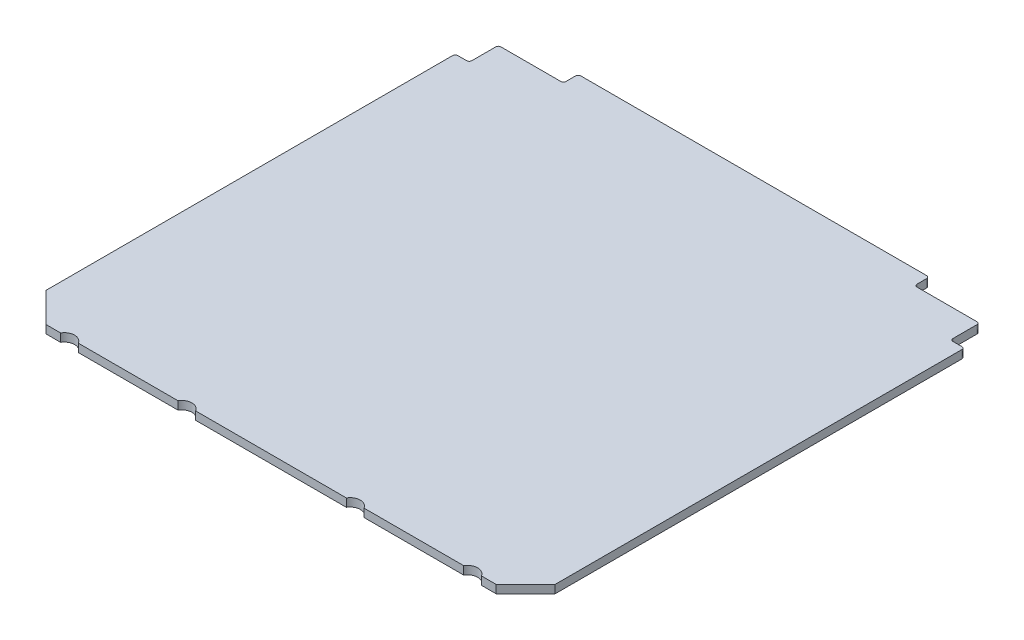
ISO-10303-21;
HEADER;
FILE_DESCRIPTION(('STEP AP214'),'2;1');
FILE_NAME('part.step','',(''),(''),'','','');
FILE_SCHEMA(('AUTOMOTIVE_DESIGN { 1 0 10303 214 1 1 1 1 }'));
ENDSEC;
DATA;
#1=APPLICATION_CONTEXT('core data for automotive mechanical design processes');
#2=APPLICATION_PROTOCOL_DEFINITION('international standard','automotive_design',2000,#1);
#3=PRODUCT_CONTEXT('',#1,'mechanical');
#4=PRODUCT('Part','Part','',(#3));
#5=PRODUCT_RELATED_PRODUCT_CATEGORY('part','',(#4));
#6=PRODUCT_DEFINITION_FORMATION('','',#4);
#7=PRODUCT_DEFINITION_CONTEXT('part definition',#1,'design');
#8=PRODUCT_DEFINITION('design','',#6,#7);
#9=PRODUCT_DEFINITION_SHAPE('','',#8);
#10=(LENGTH_UNIT() NAMED_UNIT(*) SI_UNIT(.MILLI.,.METRE.));
#11=(NAMED_UNIT(*) PLANE_ANGLE_UNIT() SI_UNIT($,.RADIAN.));
#12=(NAMED_UNIT(*) SI_UNIT($,.STERADIAN.) SOLID_ANGLE_UNIT());
#13=UNCERTAINTY_MEASURE_WITH_UNIT(LENGTH_MEASURE(1.E-05),#10,'distance_accuracy_value','');
#14=(GEOMETRIC_REPRESENTATION_CONTEXT(3) GLOBAL_UNCERTAINTY_ASSIGNED_CONTEXT((#13)) GLOBAL_UNIT_ASSIGNED_CONTEXT((#10,
#11,#12)) REPRESENTATION_CONTEXT('',''));
#15=CARTESIAN_POINT('',(0.,0.,0.));
#16=DIRECTION('',(0.,0.,1.));
#17=DIRECTION('',(1.,0.,0.));
#18=AXIS2_PLACEMENT_3D('',#15,#16,#17);
#19=CARTESIAN_POINT('',(-44.4499999999997,0.8,44.4500000000004));
#20=DIRECTION('',(0.707106781186542,0.,-0.707106781186553));
#21=DIRECTION('',(-0.707106781186553,0.,-0.707106781186542));
#22=AXIS2_PLACEMENT_3D('',#19,#20,#21);
#23=PLANE('',#22);
#24=DIRECTION('',(0.,1.,0.));
#25=VECTOR('',#24,1.);
#26=CARTESIAN_POINT('',(-44.1000000000001,-0.8,44.8));
#27=LINE('',#26,#25);
#28=CARTESIAN_POINT('',(-44.1000000000001,-0.8,44.8));
#29=VERTEX_POINT('',#28);
#30=CARTESIAN_POINT('',(-44.1000000000001,0.8,44.8));
#31=VERTEX_POINT('',#30);
#32=EDGE_CURVE('E252',#29,#31,#27,.T.);
#33=ORIENTED_EDGE('',*,*,#32,.T.);
#34=DIRECTION('',(0.707106781186553,0.,0.707106781186542));
#35=VECTOR('',#34,1.);
#36=CARTESIAN_POINT('',(-44.4499999999997,0.8,44.4500000000004));
#37=LINE('',#36,#35);
#38=CARTESIAN_POINT('',(-49.9000000000001,0.8,39.));
#39=VERTEX_POINT('',#38);
#40=EDGE_CURVE('E267',#39,#31,#37,.T.);
#41=ORIENTED_EDGE('',*,*,#40,.F.);
#42=DIRECTION('',(0.,1.,0.));
#43=VECTOR('',#42,1.);
#44=CARTESIAN_POINT('',(-49.9000000000001,-0.8,39.));
#45=LINE('',#44,#43);
#46=CARTESIAN_POINT('',(-49.9000000000001,-0.8,39.));
#47=VERTEX_POINT('',#46);
#48=EDGE_CURVE('E285',#47,#39,#45,.T.);
#49=ORIENTED_EDGE('',*,*,#48,.F.);
#50=DIRECTION('',(0.707106781186553,0.,0.707106781186542));
#51=VECTOR('',#50,1.);
#52=CARTESIAN_POINT('',(-44.4499999999997,-0.8,44.4500000000004));
#53=LINE('',#52,#51);
#54=EDGE_CURVE('E269',#47,#29,#53,.T.);
#55=ORIENTED_EDGE('',*,*,#54,.T.);
#56=EDGE_LOOP('',(#33,#41,#49,#55));
#57=FACE_BOUND('',#56,.T.);
#58=ADVANCED_FACE('F40',(#57),#23,.F.);
#59=CARTESIAN_POINT('',(44.4499999999995,0.8,44.4499999999995));
#60=DIRECTION('',(-0.707106781186548,0.,-0.707106781186548));
#61=DIRECTION('',(-0.707106781186548,0.,0.707106781186548));
#62=AXIS2_PLACEMENT_3D('',#59,#60,#61);
#63=PLANE('',#62);
#64=DIRECTION('',(0.,1.,0.));
#65=VECTOR('',#64,1.);
#66=CARTESIAN_POINT('',(44.0999999999991,-0.8,44.8));
#67=LINE('',#66,#65);
#68=CARTESIAN_POINT('',(44.0999999999991,-0.8,44.8));
#69=VERTEX_POINT('',#68);
#70=CARTESIAN_POINT('',(44.0999999999991,0.8,44.8));
#71=VERTEX_POINT('',#70);
#72=EDGE_CURVE('E270',#69,#71,#67,.T.);
#73=ORIENTED_EDGE('',*,*,#72,.F.);
#74=DIRECTION('',(0.707106781186548,0.,-0.707106781186548));
#75=VECTOR('',#74,1.);
#76=CARTESIAN_POINT('',(44.4499999999995,-0.8,44.4499999999995));
#77=LINE('',#76,#75);
#78=CARTESIAN_POINT('',(49.9000000000001,-0.8,38.999999999999));
#79=VERTEX_POINT('',#78);
#80=EDGE_CURVE('E279',#69,#79,#77,.T.);
#81=ORIENTED_EDGE('',*,*,#80,.T.);
#82=DIRECTION('',(0.,1.,0.));
#83=VECTOR('',#82,1.);
#84=CARTESIAN_POINT('',(49.9000000000001,-0.8,38.999999999999));
#85=LINE('',#84,#83);
#86=CARTESIAN_POINT('',(49.9000000000001,0.8,38.999999999999));
#87=VERTEX_POINT('',#86);
#88=EDGE_CURVE('E288',#79,#87,#85,.T.);
#89=ORIENTED_EDGE('',*,*,#88,.T.);
#90=DIRECTION('',(0.707106781186548,0.,-0.707106781186548));
#91=VECTOR('',#90,1.);
#92=CARTESIAN_POINT('',(44.4499999999995,0.8,44.4499999999995));
#93=LINE('',#92,#91);
#94=EDGE_CURVE('E278',#71,#87,#93,.T.);
#95=ORIENTED_EDGE('',*,*,#94,.F.);
#96=EDGE_LOOP('',(#73,#81,#89,#95));
#97=FACE_BOUND('',#96,.T.);
#98=ADVANCED_FACE('F564',(#97),#63,.F.);
#99=CARTESIAN_POINT('',(0.,0.8,0.));
#100=DIRECTION('',(0.,1.,0.));
#101=DIRECTION('',(0.,0.,1.));
#102=AXIS2_PLACEMENT_3D('',#99,#100,#101);
#103=PLANE('',#102);
#104=DIRECTION('',(0.,0.,-1.));
#105=VECTOR('',#104,1.);
#106=CARTESIAN_POINT('',(34.3999999999997,0.8,0.));
#107=LINE('',#106,#105);
#108=CARTESIAN_POINT('',(34.3999999999997,0.8,-47.4));
#109=VERTEX_POINT('',#108);
#110=CARTESIAN_POINT('',(34.3999999999997,0.8,-49.3));
#111=VERTEX_POINT('',#110);
#112=EDGE_CURVE('E413',#109,#111,#107,.T.);
#113=ORIENTED_EDGE('',*,*,#112,.T.);
#114=CARTESIAN_POINT('',(33.8999999999997,0.8,-49.3));
#115=DIRECTION('',(0.,1.,0.));
#116=DIRECTION('',(0.,0.,1.));
#117=AXIS2_PLACEMENT_3D('',#114,#115,#116);
#118=CIRCLE('',#117,0.5);
#119=CARTESIAN_POINT('',(33.8999999999997,0.8,-49.8));
#120=VERTEX_POINT('',#119);
#121=EDGE_CURVE('E355',#111,#120,#118,.T.);
#122=ORIENTED_EDGE('',*,*,#121,.T.);
#123=DIRECTION('',(1.,0.,0.));
#124=VECTOR('',#123,1.);
#125=CARTESIAN_POINT('',(-34.4000000000002,0.8,-49.8));
#126=LINE('',#125,#124);
#127=CARTESIAN_POINT('',(-33.9000000000002,0.8,-49.8));
#128=VERTEX_POINT('',#127);
#129=EDGE_CURVE('E510',#128,#120,#126,.T.);
#130=ORIENTED_EDGE('',*,*,#129,.F.);
#131=CARTESIAN_POINT('',(-33.9000000000002,0.8,-49.3));
#132=DIRECTION('',(0.,1.,0.));
#133=DIRECTION('',(0.,0.,1.));
#134=AXIS2_PLACEMENT_3D('',#131,#132,#133);
#135=CIRCLE('',#134,0.5);
#136=CARTESIAN_POINT('',(-34.4000000000002,0.8,-49.3));
#137=VERTEX_POINT('',#136);
#138=EDGE_CURVE('E349',#128,#137,#135,.T.);
#139=ORIENTED_EDGE('',*,*,#138,.T.);
#140=DIRECTION('',(0.,0.,1.));
#141=VECTOR('',#140,1.);
#142=CARTESIAN_POINT('',(-34.4000000000002,0.8,0.));
#143=LINE('',#142,#141);
#144=CARTESIAN_POINT('',(-34.4000000000002,0.8,-47.4));
#145=VERTEX_POINT('',#144);
#146=EDGE_CURVE('E479',#137,#145,#143,.T.);
#147=ORIENTED_EDGE('',*,*,#146,.T.);
#148=CARTESIAN_POINT('',(-34.9000000000002,0.8,-47.4));
#149=DIRECTION('',(0.,1.,0.));
#150=DIRECTION('',(0.,0.,1.));
#151=AXIS2_PLACEMENT_3D('',#148,#149,#150);
#152=CIRCLE('',#151,0.5);
#153=CARTESIAN_POINT('',(-34.9000000000002,0.8,-46.9));
#154=VERTEX_POINT('',#153);
#155=EDGE_CURVE('E341',#145,#154,#152,.F.);
#156=ORIENTED_EDGE('',*,*,#155,.T.);
#157=DIRECTION('',(-1.,0.,0.));
#158=VECTOR('',#157,1.);
#159=CARTESIAN_POINT('',(-47.1500000000002,0.8,-46.9));
#160=LINE('',#159,#158);
#161=CARTESIAN_POINT('',(-46.6500000000002,0.8,-46.9));
#162=VERTEX_POINT('',#161);
#163=EDGE_CURVE('E501',#154,#162,#160,.T.);
#164=ORIENTED_EDGE('',*,*,#163,.T.);
#165=CARTESIAN_POINT('',(-46.6500000000002,0.8,-46.4));
#166=DIRECTION('',(0.,1.,0.));
#167=DIRECTION('',(0.,0.,1.));
#168=AXIS2_PLACEMENT_3D('',#165,#166,#167);
#169=CIRCLE('',#168,0.5);
#170=CARTESIAN_POINT('',(-47.1500000000002,0.8,-46.4));
#171=VERTEX_POINT('',#170);
#172=EDGE_CURVE('E311',#162,#171,#169,.T.);
#173=ORIENTED_EDGE('',*,*,#172,.T.);
#174=DIRECTION('',(0.,0.,1.));
#175=VECTOR('',#174,1.);
#176=CARTESIAN_POINT('',(-47.1500000000002,0.8,0.));
#177=LINE('',#176,#175);
#178=CARTESIAN_POINT('',(-47.1500000000002,0.8,-41.7000000000001));
#179=VERTEX_POINT('',#178);
#180=EDGE_CURVE('E476',#171,#179,#177,.T.);
#181=ORIENTED_EDGE('',*,*,#180,.T.);
#182=CARTESIAN_POINT('',(-47.6500000000002,0.8,-41.7000000000001));
#183=DIRECTION('',(0.,1.,0.));
#184=DIRECTION('',(0.,0.,1.));
#185=AXIS2_PLACEMENT_3D('',#182,#183,#184);
#186=CIRCLE('',#185,0.5);
#187=CARTESIAN_POINT('',(-47.6500000000002,0.8,-41.2000000000001));
#188=VERTEX_POINT('',#187);
#189=EDGE_CURVE('E332',#179,#188,#186,.F.);
#190=ORIENTED_EDGE('',*,*,#189,.T.);
#191=DIRECTION('',(1.,0.,0.));
#192=VECTOR('',#191,1.);
#193=CARTESIAN_POINT('',(-49.9000000000001,0.8,-41.2000000000001));
#194=LINE('',#193,#192);
#195=CARTESIAN_POINT('',(-49.4000000000001,0.8,-41.2000000000001));
#196=VERTEX_POINT('',#195);
#197=EDGE_CURVE('E512',#196,#188,#194,.T.);
#198=ORIENTED_EDGE('',*,*,#197,.F.);
#199=CARTESIAN_POINT('',(-49.4000000000001,0.8,-40.7000000000001));
#200=DIRECTION('',(0.,1.,0.));
#201=DIRECTION('',(0.,0.,1.));
#202=AXIS2_PLACEMENT_3D('',#199,#200,#201);
#203=CIRCLE('',#202,0.5);
#204=CARTESIAN_POINT('',(-49.9000000000001,0.8,-40.7000000000001));
#205=VERTEX_POINT('',#204);
#206=EDGE_CURVE('E353',#196,#205,#203,.T.);
#207=ORIENTED_EDGE('',*,*,#206,.T.);
#208=DIRECTION('',(0.,0.,1.));
#209=VECTOR('',#208,1.);
#210=CARTESIAN_POINT('',(-49.9000000000001,0.8,0.));
#211=LINE('',#210,#209);
#212=EDGE_CURVE('E276',#205,#39,#211,.T.);
#213=ORIENTED_EDGE('',*,*,#212,.T.);
#214=ORIENTED_EDGE('',*,*,#40,.T.);
#215=DIRECTION('',(1.,0.,0.));
#216=VECTOR('',#215,1.);
#217=CARTESIAN_POINT('',(0.,0.8,44.8));
#218=LINE('',#217,#216);
#219=CARTESIAN_POINT('',(-41.2320508075689,0.8,44.8));
#220=VERTEX_POINT('',#219);
#221=EDGE_CURVE('E249',#31,#220,#218,.T.);
#222=ORIENTED_EDGE('',*,*,#221,.T.);
#223=CARTESIAN_POINT('',(-39.5,0.8,45.8));
#224=DIRECTION('',(0.,1.,0.));
#225=DIRECTION('',(0.,0.,1.));
#226=AXIS2_PLACEMENT_3D('',#223,#224,#225);
#227=CIRCLE('',#226,2.);
#228=CARTESIAN_POINT('',(-37.7679491924311,0.8,44.8));
#229=VERTEX_POINT('',#228);
#230=EDGE_CURVE('E436',#229,#220,#227,.T.);
#231=ORIENTED_EDGE('',*,*,#230,.F.);
#232=DIRECTION('',(1.,0.,0.));
#233=VECTOR('',#232,1.);
#234=CARTESIAN_POINT('',(0.,0.8,44.8));
#235=LINE('',#234,#233);
#236=CARTESIAN_POINT('',(-18.2320508075689,0.8,44.8));
#237=VERTEX_POINT('',#236);
#238=EDGE_CURVE('E440',#229,#237,#235,.T.);
#239=ORIENTED_EDGE('',*,*,#238,.T.);
#240=CARTESIAN_POINT('',(-16.5,0.8,45.8));
#241=DIRECTION('',(0.,1.,0.));
#242=DIRECTION('',(0.,0.,1.));
#243=AXIS2_PLACEMENT_3D('',#240,#241,#242);
#244=CIRCLE('',#243,2.);
#245=CARTESIAN_POINT('',(-14.7679491924311,0.8,44.8));
#246=VERTEX_POINT('',#245);
#247=EDGE_CURVE('E532',#246,#237,#244,.T.);
#248=ORIENTED_EDGE('',*,*,#247,.F.);
#249=DIRECTION('',(1.,0.,0.));
#250=VECTOR('',#249,1.);
#251=CARTESIAN_POINT('',(0.,0.8,44.8));
#252=LINE('',#251,#250);
#253=CARTESIAN_POINT('',(14.7679491924311,0.8,44.8));
#254=VERTEX_POINT('',#253);
#255=EDGE_CURVE('E529',#246,#254,#252,.T.);
#256=ORIENTED_EDGE('',*,*,#255,.T.);
#257=CARTESIAN_POINT('',(16.5,0.8,45.8));
#258=DIRECTION('',(0.,1.,0.));
#259=DIRECTION('',(0.,0.,1.));
#260=AXIS2_PLACEMENT_3D('',#257,#258,#259);
#261=CIRCLE('',#260,2.);
#262=CARTESIAN_POINT('',(18.2320508075689,0.8,44.8));
#263=VERTEX_POINT('',#262);
#264=EDGE_CURVE('E526',#263,#254,#261,.T.);
#265=ORIENTED_EDGE('',*,*,#264,.F.);
#266=DIRECTION('',(1.,0.,0.));
#267=VECTOR('',#266,1.);
#268=CARTESIAN_POINT('',(0.,0.8,44.8));
#269=LINE('',#268,#267);
#270=CARTESIAN_POINT('',(37.7679491924311,0.8,44.8));
#271=VERTEX_POINT('',#270);
#272=EDGE_CURVE('E523',#263,#271,#269,.T.);
#273=ORIENTED_EDGE('',*,*,#272,.T.);
#274=CARTESIAN_POINT('',(39.5,0.8,45.8));
#275=DIRECTION('',(0.,1.,0.));
#276=DIRECTION('',(0.,0.,1.));
#277=AXIS2_PLACEMENT_3D('',#274,#275,#276);
#278=CIRCLE('',#277,2.);
#279=CARTESIAN_POINT('',(41.2320508075689,0.8,44.8));
#280=VERTEX_POINT('',#279);
#281=EDGE_CURVE('E520',#280,#271,#278,.T.);
#282=ORIENTED_EDGE('',*,*,#281,.F.);
#283=DIRECTION('',(1.,0.,0.));
#284=VECTOR('',#283,1.);
#285=CARTESIAN_POINT('',(0.,0.8,44.8));
#286=LINE('',#285,#284);
#287=EDGE_CURVE('E260',#280,#71,#286,.T.);
#288=ORIENTED_EDGE('',*,*,#287,.T.);
#289=ORIENTED_EDGE('',*,*,#94,.T.);
#290=DIRECTION('',(0.,0.,-1.));
#291=VECTOR('',#290,1.);
#292=CARTESIAN_POINT('',(49.9000000000001,0.8,0.));
#293=LINE('',#292,#291);
#294=CARTESIAN_POINT('',(49.9000000000001,0.8,-40.7000000000001));
#295=VERTEX_POINT('',#294);
#296=EDGE_CURVE('E402',#87,#295,#293,.T.);
#297=ORIENTED_EDGE('',*,*,#296,.T.);
#298=CARTESIAN_POINT('',(49.4000000000001,0.8,-40.7000000000001));
#299=DIRECTION('',(0.,1.,0.));
#300=DIRECTION('',(0.,0.,1.));
#301=AXIS2_PLACEMENT_3D('',#298,#299,#300);
#302=CIRCLE('',#301,0.5);
#303=CARTESIAN_POINT('',(49.4000000000001,0.8,-41.2000000000001));
#304=VERTEX_POINT('',#303);
#305=EDGE_CURVE('E351',#295,#304,#302,.T.);
#306=ORIENTED_EDGE('',*,*,#305,.T.);
#307=DIRECTION('',(1.,0.,0.));
#308=VECTOR('',#307,1.);
#309=CARTESIAN_POINT('',(49.9000000000001,0.8,-41.2000000000001));
#310=LINE('',#309,#308);
#311=CARTESIAN_POINT('',(47.6499999999999,0.8,-41.2000000000001));
#312=VERTEX_POINT('',#311);
#313=EDGE_CURVE('E383',#312,#304,#310,.T.);
#314=ORIENTED_EDGE('',*,*,#313,.F.);
#315=CARTESIAN_POINT('',(47.6499999999999,0.8,-41.7000000000001));
#316=DIRECTION('',(0.,1.,0.));
#317=DIRECTION('',(0.,0.,1.));
#318=AXIS2_PLACEMENT_3D('',#315,#316,#317);
#319=CIRCLE('',#318,0.5);
#320=CARTESIAN_POINT('',(47.1499999999999,0.8,-41.7000000000001));
#321=VERTEX_POINT('',#320);
#322=EDGE_CURVE('E327',#312,#321,#319,.F.);
#323=ORIENTED_EDGE('',*,*,#322,.T.);
#324=DIRECTION('',(0.,0.,-1.));
#325=VECTOR('',#324,1.);
#326=CARTESIAN_POINT('',(47.1499999999999,0.8,0.));
#327=LINE('',#326,#325);
#328=CARTESIAN_POINT('',(47.1499999999999,0.8,-46.4));
#329=VERTEX_POINT('',#328);
#330=EDGE_CURVE('E408',#321,#329,#327,.T.);
#331=ORIENTED_EDGE('',*,*,#330,.T.);
#332=CARTESIAN_POINT('',(46.6499999999999,0.8,-46.4));
#333=DIRECTION('',(0.,1.,0.));
#334=DIRECTION('',(0.,0.,1.));
#335=AXIS2_PLACEMENT_3D('',#332,#333,#334);
#336=CIRCLE('',#335,0.5);
#337=CARTESIAN_POINT('',(46.6499999999999,0.8,-46.9));
#338=VERTEX_POINT('',#337);
#339=EDGE_CURVE('E313',#329,#338,#336,.T.);
#340=ORIENTED_EDGE('',*,*,#339,.T.);
#341=DIRECTION('',(-1.,0.,0.));
#342=VECTOR('',#341,1.);
#343=CARTESIAN_POINT('',(34.3999999999997,0.8,-46.9));
#344=LINE('',#343,#342);
#345=CARTESIAN_POINT('',(34.8999999999997,0.8,-46.9));
#346=VERTEX_POINT('',#345);
#347=EDGE_CURVE('E502',#338,#346,#344,.T.);
#348=ORIENTED_EDGE('',*,*,#347,.T.);
#349=CARTESIAN_POINT('',(34.8999999999997,0.8,-47.4));
#350=DIRECTION('',(0.,1.,0.));
#351=DIRECTION('',(0.,0.,1.));
#352=AXIS2_PLACEMENT_3D('',#349,#350,#351);
#353=CIRCLE('',#352,0.5);
#354=EDGE_CURVE('E337',#346,#109,#353,.F.);
#355=ORIENTED_EDGE('',*,*,#354,.T.);
#356=EDGE_LOOP('',(#113,#122,#130,#139,#147,#156,#164,#173,#181,#190,#198,#207,#213,#214,#222,
#231,#239,#248,#256,#265,#273,#282,#288,#289,#297,#306,#314,#323,#331,#340,#348,#355));
#357=FACE_BOUND('',#356,.T.);
#358=ADVANCED_FACE('F274',(#357),#103,.T.);
#359=CARTESIAN_POINT('',(0.,-0.8,0.));
#360=DIRECTION('',(0.,1.,0.));
#361=DIRECTION('',(0.,0.,1.));
#362=AXIS2_PLACEMENT_3D('',#359,#360,#361);
#363=PLANE('',#362);
#364=DIRECTION('',(-1.,0.,0.));
#365=VECTOR('',#364,1.);
#366=CARTESIAN_POINT('',(-34.4000000000002,-0.8,-49.8));
#367=LINE('',#366,#365);
#368=CARTESIAN_POINT('',(33.8999999999997,-0.8,-49.8));
#369=VERTEX_POINT('',#368);
#370=CARTESIAN_POINT('',(-33.9000000000002,-0.8,-49.8));
#371=VERTEX_POINT('',#370);
#372=EDGE_CURVE('E393',#369,#371,#367,.T.);
#373=ORIENTED_EDGE('',*,*,#372,.F.);
#374=CARTESIAN_POINT('',(33.8999999999997,-0.8,-49.3));
#375=DIRECTION('',(0.,1.,0.));
#376=DIRECTION('',(0.,0.,1.));
#377=AXIS2_PLACEMENT_3D('',#374,#375,#376);
#378=CIRCLE('',#377,0.5);
#379=CARTESIAN_POINT('',(34.3999999999997,-0.8,-49.3));
#380=VERTEX_POINT('',#379);
#381=EDGE_CURVE('E367',#369,#380,#378,.F.);
#382=ORIENTED_EDGE('',*,*,#381,.T.);
#383=DIRECTION('',(0.,0.,-1.));
#384=VECTOR('',#383,1.);
#385=CARTESIAN_POINT('',(34.3999999999997,-0.8,0.));
#386=LINE('',#385,#384);
#387=CARTESIAN_POINT('',(34.3999999999997,-0.8,-47.4));
#388=VERTEX_POINT('',#387);
#389=EDGE_CURVE('E421',#388,#380,#386,.T.);
#390=ORIENTED_EDGE('',*,*,#389,.F.);
#391=CARTESIAN_POINT('',(34.8999999999997,-0.8,-47.4));
#392=DIRECTION('',(0.,1.,0.));
#393=DIRECTION('',(0.,0.,1.));
#394=AXIS2_PLACEMENT_3D('',#391,#392,#393);
#395=CIRCLE('',#394,0.5);
#396=CARTESIAN_POINT('',(34.8999999999997,-0.8,-46.9));
#397=VERTEX_POINT('',#396);
#398=EDGE_CURVE('E339',#388,#397,#395,.T.);
#399=ORIENTED_EDGE('',*,*,#398,.T.);
#400=DIRECTION('',(1.,0.,0.));
#401=VECTOR('',#400,1.);
#402=CARTESIAN_POINT('',(34.3999999999997,-0.8,-46.9));
#403=LINE('',#402,#401);
#404=CARTESIAN_POINT('',(46.6499999999999,-0.8,-46.9));
#405=VERTEX_POINT('',#404);
#406=EDGE_CURVE('E495',#397,#405,#403,.T.);
#407=ORIENTED_EDGE('',*,*,#406,.T.);
#408=CARTESIAN_POINT('',(46.6499999999999,-0.8,-46.4));
#409=DIRECTION('',(0.,1.,0.));
#410=DIRECTION('',(0.,0.,1.));
#411=AXIS2_PLACEMENT_3D('',#408,#409,#410);
#412=CIRCLE('',#411,0.5);
#413=CARTESIAN_POINT('',(47.1499999999999,-0.8,-46.4));
#414=VERTEX_POINT('',#413);
#415=EDGE_CURVE('E317',#405,#414,#412,.F.);
#416=ORIENTED_EDGE('',*,*,#415,.T.);
#417=DIRECTION('',(0.,0.,-1.));
#418=VECTOR('',#417,1.);
#419=CARTESIAN_POINT('',(47.1499999999999,-0.8,0.));
#420=LINE('',#419,#418);
#421=CARTESIAN_POINT('',(47.1499999999999,-0.8,-41.7000000000001));
#422=VERTEX_POINT('',#421);
#423=EDGE_CURVE('E424',#422,#414,#420,.T.);
#424=ORIENTED_EDGE('',*,*,#423,.F.);
#425=CARTESIAN_POINT('',(47.6499999999999,-0.8,-41.7000000000001));
#426=DIRECTION('',(0.,1.,0.));
#427=DIRECTION('',(0.,0.,1.));
#428=AXIS2_PLACEMENT_3D('',#425,#426,#427);
#429=CIRCLE('',#428,0.5);
#430=CARTESIAN_POINT('',(47.6499999999999,-0.8,-41.2000000000001));
#431=VERTEX_POINT('',#430);
#432=EDGE_CURVE('E329',#422,#431,#429,.T.);
#433=ORIENTED_EDGE('',*,*,#432,.T.);
#434=DIRECTION('',(-1.,0.,0.));
#435=VECTOR('',#434,1.);
#436=CARTESIAN_POINT('',(49.9000000000001,-0.8,-41.2000000000001));
#437=LINE('',#436,#435);
#438=CARTESIAN_POINT('',(49.4000000000001,-0.8,-41.2000000000001));
#439=VERTEX_POINT('',#438);
#440=EDGE_CURVE('E381',#439,#431,#437,.T.);
#441=ORIENTED_EDGE('',*,*,#440,.F.);
#442=CARTESIAN_POINT('',(49.4000000000001,-0.8,-40.7000000000001));
#443=DIRECTION('',(0.,1.,0.));
#444=DIRECTION('',(0.,0.,1.));
#445=AXIS2_PLACEMENT_3D('',#442,#443,#444);
#446=CIRCLE('',#445,0.5);
#447=CARTESIAN_POINT('',(49.9000000000001,-0.8,-40.7000000000001));
#448=VERTEX_POINT('',#447);
#449=EDGE_CURVE('E364',#439,#448,#446,.F.);
#450=ORIENTED_EDGE('',*,*,#449,.T.);
#451=DIRECTION('',(0.,0.,-1.));
#452=VECTOR('',#451,1.);
#453=CARTESIAN_POINT('',(49.9000000000001,-0.8,0.));
#454=LINE('',#453,#452);
#455=EDGE_CURVE('E404',#79,#448,#454,.T.);
#456=ORIENTED_EDGE('',*,*,#455,.F.);
#457=ORIENTED_EDGE('',*,*,#80,.F.);
#458=DIRECTION('',(1.,0.,0.));
#459=VECTOR('',#458,1.);
#460=CARTESIAN_POINT('',(0.,-0.8,44.8));
#461=LINE('',#460,#459);
#462=CARTESIAN_POINT('',(41.2320508075689,-0.8,44.8));
#463=VERTEX_POINT('',#462);
#464=EDGE_CURVE('E435',#463,#69,#461,.T.);
#465=ORIENTED_EDGE('',*,*,#464,.F.);
#466=CARTESIAN_POINT('',(39.5,-0.8,45.8));
#467=DIRECTION('',(0.,1.,0.));
#468=DIRECTION('',(0.,0.,1.));
#469=AXIS2_PLACEMENT_3D('',#466,#467,#468);
#470=CIRCLE('',#469,2.);
#471=CARTESIAN_POINT('',(37.7679491924311,-0.8,44.8));
#472=VERTEX_POINT('',#471);
#473=EDGE_CURVE('E438',#463,#472,#470,.T.);
#474=ORIENTED_EDGE('',*,*,#473,.T.);
#475=DIRECTION('',(1.,0.,0.));
#476=VECTOR('',#475,1.);
#477=CARTESIAN_POINT('',(0.,-0.8,44.8));
#478=LINE('',#477,#476);
#479=CARTESIAN_POINT('',(18.2320508075689,-0.8,44.8));
#480=VERTEX_POINT('',#479);
#481=EDGE_CURVE('E446',#480,#472,#478,.T.);
#482=ORIENTED_EDGE('',*,*,#481,.F.);
#483=CARTESIAN_POINT('',(16.5,-0.8,45.8));
#484=DIRECTION('',(0.,1.,0.));
#485=DIRECTION('',(0.,0.,1.));
#486=AXIS2_PLACEMENT_3D('',#483,#484,#485);
#487=CIRCLE('',#486,2.);
#488=CARTESIAN_POINT('',(14.7679491924311,-0.8,44.8));
#489=VERTEX_POINT('',#488);
#490=EDGE_CURVE('E448',#480,#489,#487,.T.);
#491=ORIENTED_EDGE('',*,*,#490,.T.);
#492=DIRECTION('',(1.,0.,0.));
#493=VECTOR('',#492,1.);
#494=CARTESIAN_POINT('',(0.,-0.8,44.8));
#495=LINE('',#494,#493);
#496=CARTESIAN_POINT('',(-14.7679491924311,-0.8,44.8));
#497=VERTEX_POINT('',#496);
#498=EDGE_CURVE('E451',#497,#489,#495,.T.);
#499=ORIENTED_EDGE('',*,*,#498,.F.);
#500=CARTESIAN_POINT('',(-16.5,-0.8,45.8));
#501=DIRECTION('',(0.,1.,0.));
#502=DIRECTION('',(0.,0.,1.));
#503=AXIS2_PLACEMENT_3D('',#500,#501,#502);
#504=CIRCLE('',#503,2.);
#505=CARTESIAN_POINT('',(-18.2320508075689,-0.8,44.8));
#506=VERTEX_POINT('',#505);
#507=EDGE_CURVE('E453',#497,#506,#504,.T.);
#508=ORIENTED_EDGE('',*,*,#507,.T.);
#509=DIRECTION('',(1.,0.,0.));
#510=VECTOR('',#509,1.);
#511=CARTESIAN_POINT('',(0.,-0.8,44.8));
#512=LINE('',#511,#510);
#513=CARTESIAN_POINT('',(-37.7679491924311,-0.8,44.8));
#514=VERTEX_POINT('',#513);
#515=EDGE_CURVE('E456',#514,#506,#512,.T.);
#516=ORIENTED_EDGE('',*,*,#515,.F.);
#517=CARTESIAN_POINT('',(-39.5,-0.8,45.8));
#518=DIRECTION('',(0.,1.,0.));
#519=DIRECTION('',(0.,0.,1.));
#520=AXIS2_PLACEMENT_3D('',#517,#518,#519);
#521=CIRCLE('',#520,2.);
#522=CARTESIAN_POINT('',(-41.2320508075689,-0.8,44.8));
#523=VERTEX_POINT('',#522);
#524=EDGE_CURVE('E271',#514,#523,#521,.T.);
#525=ORIENTED_EDGE('',*,*,#524,.T.);
#526=DIRECTION('',(1.,0.,0.));
#527=VECTOR('',#526,1.);
#528=CARTESIAN_POINT('',(0.,-0.8,44.8));
#529=LINE('',#528,#527);
#530=EDGE_CURVE('E432',#29,#523,#529,.T.);
#531=ORIENTED_EDGE('',*,*,#530,.F.);
#532=ORIENTED_EDGE('',*,*,#54,.F.);
#533=DIRECTION('',(0.,0.,1.));
#534=VECTOR('',#533,1.);
#535=CARTESIAN_POINT('',(-49.9000000000001,-0.8,0.));
#536=LINE('',#535,#534);
#537=CARTESIAN_POINT('',(-49.9000000000001,-0.8,-40.7000000000001));
#538=VERTEX_POINT('',#537);
#539=EDGE_CURVE('E407',#538,#47,#536,.T.);
#540=ORIENTED_EDGE('',*,*,#539,.F.);
#541=CARTESIAN_POINT('',(-49.4000000000001,-0.8,-40.7000000000001));
#542=DIRECTION('',(0.,1.,0.));
#543=DIRECTION('',(0.,0.,1.));
#544=AXIS2_PLACEMENT_3D('',#541,#542,#543);
#545=CIRCLE('',#544,0.5);
#546=CARTESIAN_POINT('',(-49.4000000000001,-0.8,-41.2000000000001));
#547=VERTEX_POINT('',#546);
#548=EDGE_CURVE('E61',#538,#547,#545,.F.);
#549=ORIENTED_EDGE('',*,*,#548,.T.);
#550=DIRECTION('',(-1.,0.,0.));
#551=VECTOR('',#550,1.);
#552=CARTESIAN_POINT('',(-49.9000000000001,-0.8,-41.2000000000001));
#553=LINE('',#552,#551);
#554=CARTESIAN_POINT('',(-47.6500000000002,-0.8,-41.2000000000001));
#555=VERTEX_POINT('',#554);
#556=EDGE_CURVE('E261',#555,#547,#553,.T.);
#557=ORIENTED_EDGE('',*,*,#556,.F.);
#558=CARTESIAN_POINT('',(-47.6500000000002,-0.8,-41.7000000000001));
#559=DIRECTION('',(0.,1.,0.));
#560=DIRECTION('',(0.,0.,1.));
#561=AXIS2_PLACEMENT_3D('',#558,#559,#560);
#562=CIRCLE('',#561,0.5);
#563=CARTESIAN_POINT('',(-47.1500000000002,-0.8,-41.7000000000001));
#564=VERTEX_POINT('',#563);
#565=EDGE_CURVE('E335',#555,#564,#562,.T.);
#566=ORIENTED_EDGE('',*,*,#565,.T.);
#567=DIRECTION('',(0.,0.,1.));
#568=VECTOR('',#567,1.);
#569=CARTESIAN_POINT('',(-47.1500000000002,-0.8,0.));
#570=LINE('',#569,#568);
#571=CARTESIAN_POINT('',(-47.1500000000002,-0.8,-46.4));
#572=VERTEX_POINT('',#571);
#573=EDGE_CURVE('E410',#572,#564,#570,.T.);
#574=ORIENTED_EDGE('',*,*,#573,.F.);
#575=CARTESIAN_POINT('',(-46.6500000000002,-0.8,-46.4));
#576=DIRECTION('',(0.,1.,0.));
#577=DIRECTION('',(0.,0.,1.));
#578=AXIS2_PLACEMENT_3D('',#575,#576,#577);
#579=CIRCLE('',#578,0.5);
#580=CARTESIAN_POINT('',(-46.6500000000002,-0.8,-46.9));
#581=VERTEX_POINT('',#580);
#582=EDGE_CURVE('E315',#572,#581,#579,.F.);
#583=ORIENTED_EDGE('',*,*,#582,.T.);
#584=DIRECTION('',(1.,0.,0.));
#585=VECTOR('',#584,1.);
#586=CARTESIAN_POINT('',(-47.1500000000002,-0.8,-46.9));
#587=LINE('',#586,#585);
#588=CARTESIAN_POINT('',(-34.9000000000002,-0.8,-46.9));
#589=VERTEX_POINT('',#588);
#590=EDGE_CURVE('E505',#581,#589,#587,.T.);
#591=ORIENTED_EDGE('',*,*,#590,.T.);
#592=CARTESIAN_POINT('',(-34.9000000000002,-0.8,-47.4));
#593=DIRECTION('',(0.,1.,0.));
#594=DIRECTION('',(0.,0.,1.));
#595=AXIS2_PLACEMENT_3D('',#592,#593,#594);
#596=CIRCLE('',#595,0.5);
#597=CARTESIAN_POINT('',(-34.4000000000002,-0.8,-47.4));
#598=VERTEX_POINT('',#597);
#599=EDGE_CURVE('E343',#589,#598,#596,.T.);
#600=ORIENTED_EDGE('',*,*,#599,.T.);
#601=DIRECTION('',(0.,0.,1.));
#602=VECTOR('',#601,1.);
#603=CARTESIAN_POINT('',(-34.4000000000002,-0.8,0.));
#604=LINE('',#603,#602);
#605=CARTESIAN_POINT('',(-34.4000000000002,-0.8,-49.3));
#606=VERTEX_POINT('',#605);
#607=EDGE_CURVE('E419',#606,#598,#604,.T.);
#608=ORIENTED_EDGE('',*,*,#607,.F.);
#609=CARTESIAN_POINT('',(-33.9000000000002,-0.8,-49.3));
#610=DIRECTION('',(0.,1.,0.));
#611=DIRECTION('',(0.,0.,1.));
#612=AXIS2_PLACEMENT_3D('',#609,#610,#611);
#613=CIRCLE('',#612,0.5);
#614=EDGE_CURVE('E362',#606,#371,#613,.F.);
#615=ORIENTED_EDGE('',*,*,#614,.T.);
#616=EDGE_LOOP('',(#373,#382,#390,#399,#407,#416,#424,#433,#441,#450,#456,#457,#465,#474,#482,
#491,#499,#508,#516,#525,#531,#532,#540,#549,#557,#566,#574,#583,#591,#600,#608,#615));
#617=FACE_BOUND('',#616,.T.);
#618=ADVANCED_FACE('F387',(#617),#363,.F.);
#619=CARTESIAN_POINT('',(49.9000000000001,-0.8,0.));
#620=DIRECTION('',(1.,0.,0.));
#621=DIRECTION('',(0.,0.,-1.));
#622=AXIS2_PLACEMENT_3D('',#619,#620,#621);
#623=PLANE('',#622);
#624=ORIENTED_EDGE('',*,*,#455,.T.);
#625=DIRECTION('',(0.,1.,0.));
#626=VECTOR('',#625,1.);
#627=CARTESIAN_POINT('',(49.9000000000001,0.8,-40.7000000000001));
#628=LINE('',#627,#626);
#629=EDGE_CURVE('E374',#448,#295,#628,.T.);
#630=ORIENTED_EDGE('',*,*,#629,.T.);
#631=ORIENTED_EDGE('',*,*,#296,.F.);
#632=ORIENTED_EDGE('',*,*,#88,.F.);
#633=EDGE_LOOP('',(#624,#630,#631,#632));
#634=FACE_BOUND('',#633,.T.);
#635=ADVANCED_FACE('F400',(#634),#623,.T.);
#636=CARTESIAN_POINT('',(47.1499999999999,-0.8,0.));
#637=DIRECTION('',(1.,0.,0.));
#638=DIRECTION('',(0.,0.,-1.));
#639=AXIS2_PLACEMENT_3D('',#636,#637,#638);
#640=PLANE('',#639);
#641=ORIENTED_EDGE('',*,*,#330,.F.);
#642=DIRECTION('',(0.,1.,0.));
#643=VECTOR('',#642,1.);
#644=CARTESIAN_POINT('',(47.1499999999999,-0.8,-41.7000000000001));
#645=LINE('',#644,#643);
#646=EDGE_CURVE('E295',#321,#422,#645,.F.);
#647=ORIENTED_EDGE('',*,*,#646,.T.);
#648=ORIENTED_EDGE('',*,*,#423,.T.);
#649=DIRECTION('',(0.,1.,0.));
#650=VECTOR('',#649,1.);
#651=CARTESIAN_POINT('',(47.1499999999999,-0.8,-46.4));
#652=LINE('',#651,#650);
#653=EDGE_CURVE('E292',#414,#329,#652,.T.);
#654=ORIENTED_EDGE('',*,*,#653,.T.);
#655=EDGE_LOOP('',(#641,#647,#648,#654));
#656=FACE_BOUND('',#655,.T.);
#657=ADVANCED_FACE('F665',(#656),#640,.T.);
#658=CARTESIAN_POINT('',(34.3999999999997,-0.8,0.));
#659=DIRECTION('',(1.,0.,0.));
#660=DIRECTION('',(0.,0.,-1.));
#661=AXIS2_PLACEMENT_3D('',#658,#659,#660);
#662=PLANE('',#661);
#663=ORIENTED_EDGE('',*,*,#389,.T.);
#664=DIRECTION('',(0.,1.,0.));
#665=VECTOR('',#664,1.);
#666=CARTESIAN_POINT('',(34.3999999999997,0.8,-49.3));
#667=LINE('',#666,#665);
#668=EDGE_CURVE('E346',#380,#111,#667,.T.);
#669=ORIENTED_EDGE('',*,*,#668,.T.);
#670=ORIENTED_EDGE('',*,*,#112,.F.);
#671=DIRECTION('',(0.,1.,0.));
#672=VECTOR('',#671,1.);
#673=CARTESIAN_POINT('',(34.3999999999997,-0.8,-47.4));
#674=LINE('',#673,#672);
#675=EDGE_CURVE('E309',#109,#388,#674,.F.);
#676=ORIENTED_EDGE('',*,*,#675,.T.);
#677=EDGE_LOOP('',(#663,#669,#670,#676));
#678=FACE_BOUND('',#677,.T.);
#679=ADVANCED_FACE('F486',(#678),#662,.T.);
#680=CARTESIAN_POINT('',(-34.4000000000002,-0.8,0.));
#681=DIRECTION('',(-1.,0.,0.));
#682=DIRECTION('',(0.,0.,1.));
#683=AXIS2_PLACEMENT_3D('',#680,#681,#682);
#684=PLANE('',#683);
#685=ORIENTED_EDGE('',*,*,#146,.F.);
#686=DIRECTION('',(0.,1.,0.));
#687=VECTOR('',#686,1.);
#688=CARTESIAN_POINT('',(-34.4000000000002,-0.8,-49.3));
#689=LINE('',#688,#687);
#690=EDGE_CURVE('E11',#137,#606,#689,.F.);
#691=ORIENTED_EDGE('',*,*,#690,.T.);
#692=ORIENTED_EDGE('',*,*,#607,.T.);
#693=DIRECTION('',(0.,1.,0.));
#694=VECTOR('',#693,1.);
#695=CARTESIAN_POINT('',(-34.4000000000002,0.8,-47.4));
#696=LINE('',#695,#694);
#697=EDGE_CURVE('E319',#598,#145,#696,.T.);
#698=ORIENTED_EDGE('',*,*,#697,.T.);
#699=EDGE_LOOP('',(#685,#691,#692,#698));
#700=FACE_BOUND('',#699,.T.);
#701=ADVANCED_FACE('F630',(#700),#684,.T.);
#702=CARTESIAN_POINT('',(-47.1500000000002,-0.8,0.));
#703=DIRECTION('',(-1.,0.,0.));
#704=DIRECTION('',(0.,0.,1.));
#705=AXIS2_PLACEMENT_3D('',#702,#703,#704);
#706=PLANE('',#705);
#707=ORIENTED_EDGE('',*,*,#573,.T.);
#708=DIRECTION('',(0.,1.,0.));
#709=VECTOR('',#708,1.);
#710=CARTESIAN_POINT('',(-47.1500000000002,-0.8,-41.7000000000001));
#711=LINE('',#710,#709);
#712=EDGE_CURVE('E299',#564,#179,#711,.T.);
#713=ORIENTED_EDGE('',*,*,#712,.T.);
#714=ORIENTED_EDGE('',*,*,#180,.F.);
#715=DIRECTION('',(0.,1.,0.));
#716=VECTOR('',#715,1.);
#717=CARTESIAN_POINT('',(-47.1500000000002,-0.8,-46.4));
#718=LINE('',#717,#716);
#719=EDGE_CURVE('E297',#171,#572,#718,.F.);
#720=ORIENTED_EDGE('',*,*,#719,.T.);
#721=EDGE_LOOP('',(#707,#713,#714,#720));
#722=FACE_BOUND('',#721,.T.);
#723=ADVANCED_FACE('F643',(#722),#706,.T.);
#724=CARTESIAN_POINT('',(-49.9000000000001,-0.8,0.));
#725=DIRECTION('',(-1.,0.,0.));
#726=DIRECTION('',(0.,0.,1.));
#727=AXIS2_PLACEMENT_3D('',#724,#725,#726);
#728=PLANE('',#727);
#729=ORIENTED_EDGE('',*,*,#212,.F.);
#730=DIRECTION('',(0.,1.,0.));
#731=VECTOR('',#730,1.);
#732=CARTESIAN_POINT('',(-49.9000000000001,-0.8,-40.7000000000001));
#733=LINE('',#732,#731);
#734=EDGE_CURVE('E372',#205,#538,#733,.F.);
#735=ORIENTED_EDGE('',*,*,#734,.T.);
#736=ORIENTED_EDGE('',*,*,#539,.T.);
#737=ORIENTED_EDGE('',*,*,#48,.T.);
#738=EDGE_LOOP('',(#729,#735,#736,#737));
#739=FACE_BOUND('',#738,.T.);
#740=ADVANCED_FACE('F429',(#739),#728,.T.);
#741=CARTESIAN_POINT('',(0.,-0.8,44.8));
#742=DIRECTION('',(0.,0.,1.));
#743=DIRECTION('',(1.,0.,0.));
#744=AXIS2_PLACEMENT_3D('',#741,#742,#743);
#745=PLANE('',#744);
#746=ORIENTED_EDGE('',*,*,#32,.F.);
#747=ORIENTED_EDGE('',*,*,#530,.T.);
#748=DIRECTION('',(0.,1.,0.));
#749=VECTOR('',#748,1.);
#750=CARTESIAN_POINT('',(-41.2320508075689,-0.8,44.8));
#751=LINE('',#750,#749);
#752=EDGE_CURVE('E255',#523,#220,#751,.T.);
#753=ORIENTED_EDGE('',*,*,#752,.T.);
#754=ORIENTED_EDGE('',*,*,#221,.F.);
#755=EDGE_LOOP('',(#746,#747,#753,#754));
#756=FACE_BOUND('',#755,.T.);
#757=ADVANCED_FACE('F251',(#756),#745,.T.);
#758=CARTESIAN_POINT('',(-39.5,-0.8,45.8));
#759=DIRECTION('',(0.,1.,0.));
#760=DIRECTION('',(0.,0.,1.));
#761=AXIS2_PLACEMENT_3D('',#758,#759,#760);
#762=CYLINDRICAL_SURFACE('',#761,2.);
#763=ORIENTED_EDGE('',*,*,#752,.F.);
#764=ORIENTED_EDGE('',*,*,#524,.F.);
#765=DIRECTION('',(0.,1.,0.));
#766=VECTOR('',#765,1.);
#767=CARTESIAN_POINT('',(-37.7679491924311,-0.8,44.8));
#768=LINE('',#767,#766);
#769=EDGE_CURVE('E460',#514,#229,#768,.T.);
#770=ORIENTED_EDGE('',*,*,#769,.T.);
#771=ORIENTED_EDGE('',*,*,#230,.T.);
#772=EDGE_LOOP('',(#763,#764,#770,#771));
#773=FACE_BOUND('',#772,.T.);
#774=ADVANCED_FACE('F834',(#773),#762,.F.);
#775=CARTESIAN_POINT('',(0.,-0.8,44.8));
#776=DIRECTION('',(0.,0.,1.));
#777=DIRECTION('',(1.,0.,0.));
#778=AXIS2_PLACEMENT_3D('',#775,#776,#777);
#779=PLANE('',#778);
#780=ORIENTED_EDGE('',*,*,#769,.F.);
#781=ORIENTED_EDGE('',*,*,#515,.T.);
#782=DIRECTION('',(0.,1.,0.));
#783=VECTOR('',#782,1.);
#784=CARTESIAN_POINT('',(-18.2320508075689,-0.8,44.8));
#785=LINE('',#784,#783);
#786=EDGE_CURVE('E462',#506,#237,#785,.T.);
#787=ORIENTED_EDGE('',*,*,#786,.T.);
#788=ORIENTED_EDGE('',*,*,#238,.F.);
#789=EDGE_LOOP('',(#780,#781,#787,#788));
#790=FACE_BOUND('',#789,.T.);
#791=ADVANCED_FACE('F538',(#790),#779,.T.);
#792=CARTESIAN_POINT('',(-16.5,-0.8,45.8));
#793=DIRECTION('',(0.,1.,0.));
#794=DIRECTION('',(0.,0.,1.));
#795=AXIS2_PLACEMENT_3D('',#792,#793,#794);
#796=CYLINDRICAL_SURFACE('',#795,2.);
#797=ORIENTED_EDGE('',*,*,#786,.F.);
#798=ORIENTED_EDGE('',*,*,#507,.F.);
#799=DIRECTION('',(0.,1.,0.));
#800=VECTOR('',#799,1.);
#801=CARTESIAN_POINT('',(-14.7679491924311,-0.8,44.8));
#802=LINE('',#801,#800);
#803=EDGE_CURVE('E464',#497,#246,#802,.T.);
#804=ORIENTED_EDGE('',*,*,#803,.T.);
#805=ORIENTED_EDGE('',*,*,#247,.T.);
#806=EDGE_LOOP('',(#797,#798,#804,#805));
#807=FACE_BOUND('',#806,.T.);
#808=ADVANCED_FACE('F542',(#807),#796,.F.);
#809=CARTESIAN_POINT('',(0.,-0.8,44.8));
#810=DIRECTION('',(0.,0.,1.));
#811=DIRECTION('',(1.,0.,0.));
#812=AXIS2_PLACEMENT_3D('',#809,#810,#811);
#813=PLANE('',#812);
#814=ORIENTED_EDGE('',*,*,#803,.F.);
#815=ORIENTED_EDGE('',*,*,#498,.T.);
#816=DIRECTION('',(0.,1.,0.));
#817=VECTOR('',#816,1.);
#818=CARTESIAN_POINT('',(14.7679491924311,-0.8,44.8));
#819=LINE('',#818,#817);
#820=EDGE_CURVE('E466',#489,#254,#819,.T.);
#821=ORIENTED_EDGE('',*,*,#820,.T.);
#822=ORIENTED_EDGE('',*,*,#255,.F.);
#823=EDGE_LOOP('',(#814,#815,#821,#822));
#824=FACE_BOUND('',#823,.T.);
#825=ADVANCED_FACE('F546',(#824),#813,.T.);
#826=CARTESIAN_POINT('',(16.5,-0.8,45.8));
#827=DIRECTION('',(0.,1.,0.));
#828=DIRECTION('',(0.,0.,1.));
#829=AXIS2_PLACEMENT_3D('',#826,#827,#828);
#830=CYLINDRICAL_SURFACE('',#829,2.);
#831=ORIENTED_EDGE('',*,*,#820,.F.);
#832=ORIENTED_EDGE('',*,*,#490,.F.);
#833=DIRECTION('',(0.,1.,0.));
#834=VECTOR('',#833,1.);
#835=CARTESIAN_POINT('',(18.2320508075689,-0.8,44.8));
#836=LINE('',#835,#834);
#837=EDGE_CURVE('E468',#480,#263,#836,.T.);
#838=ORIENTED_EDGE('',*,*,#837,.T.);
#839=ORIENTED_EDGE('',*,*,#264,.T.);
#840=EDGE_LOOP('',(#831,#832,#838,#839));
#841=FACE_BOUND('',#840,.T.);
#842=ADVANCED_FACE('F552',(#841),#830,.F.);
#843=CARTESIAN_POINT('',(0.,-0.8,44.8));
#844=DIRECTION('',(0.,0.,1.));
#845=DIRECTION('',(1.,0.,0.));
#846=AXIS2_PLACEMENT_3D('',#843,#844,#845);
#847=PLANE('',#846);
#848=ORIENTED_EDGE('',*,*,#837,.F.);
#849=ORIENTED_EDGE('',*,*,#481,.T.);
#850=DIRECTION('',(0.,1.,0.));
#851=VECTOR('',#850,1.);
#852=CARTESIAN_POINT('',(37.7679491924311,-0.8,44.8));
#853=LINE('',#852,#851);
#854=EDGE_CURVE('E470',#472,#271,#853,.T.);
#855=ORIENTED_EDGE('',*,*,#854,.T.);
#856=ORIENTED_EDGE('',*,*,#272,.F.);
#857=EDGE_LOOP('',(#848,#849,#855,#856));
#858=FACE_BOUND('',#857,.T.);
#859=ADVANCED_FACE('F556',(#858),#847,.T.);
#860=CARTESIAN_POINT('',(39.5,-0.8,45.8));
#861=DIRECTION('',(0.,1.,0.));
#862=DIRECTION('',(0.,0.,1.));
#863=AXIS2_PLACEMENT_3D('',#860,#861,#862);
#864=CYLINDRICAL_SURFACE('',#863,2.);
#865=ORIENTED_EDGE('',*,*,#854,.F.);
#866=ORIENTED_EDGE('',*,*,#473,.F.);
#867=DIRECTION('',(0.,1.,0.));
#868=VECTOR('',#867,1.);
#869=CARTESIAN_POINT('',(41.2320508075689,-0.8,44.8));
#870=LINE('',#869,#868);
#871=EDGE_CURVE('E472',#463,#280,#870,.T.);
#872=ORIENTED_EDGE('',*,*,#871,.T.);
#873=ORIENTED_EDGE('',*,*,#281,.T.);
#874=EDGE_LOOP('',(#865,#866,#872,#873));
#875=FACE_BOUND('',#874,.T.);
#876=ADVANCED_FACE('F559',(#875),#864,.F.);
#877=CARTESIAN_POINT('',(0.,-0.8,44.8));
#878=DIRECTION('',(0.,0.,1.));
#879=DIRECTION('',(1.,0.,0.));
#880=AXIS2_PLACEMENT_3D('',#877,#878,#879);
#881=PLANE('',#880);
#882=ORIENTED_EDGE('',*,*,#871,.F.);
#883=ORIENTED_EDGE('',*,*,#464,.T.);
#884=ORIENTED_EDGE('',*,*,#72,.T.);
#885=ORIENTED_EDGE('',*,*,#287,.F.);
#886=EDGE_LOOP('',(#882,#883,#884,#885));
#887=FACE_BOUND('',#886,.T.);
#888=ADVANCED_FACE('F567',(#887),#881,.T.);
#889=CARTESIAN_POINT('',(-49.9000000000001,-0.801,-41.2000000000001));
#890=DIRECTION('',(0.,0.,1.));
#891=DIRECTION('',(1.,0.,0.));
#892=AXIS2_PLACEMENT_3D('',#889,#890,#891);
#893=PLANE('',#892);
#894=ORIENTED_EDGE('',*,*,#556,.T.);
#895=DIRECTION('',(0.,1.,0.));
#896=VECTOR('',#895,1.);
#897=CARTESIAN_POINT('',(-49.4000000000001,0.8,-41.2000000000001));
#898=LINE('',#897,#896);
#899=EDGE_CURVE('E369',#547,#196,#898,.T.);
#900=ORIENTED_EDGE('',*,*,#899,.T.);
#901=ORIENTED_EDGE('',*,*,#197,.T.);
#902=DIRECTION('',(0.,1.,0.));
#903=VECTOR('',#902,1.);
#904=CARTESIAN_POINT('',(-47.6500000000002,-0.801,-41.2000000000001));
#905=LINE('',#904,#903);
#906=EDGE_CURVE('E302',#188,#555,#905,.F.);
#907=ORIENTED_EDGE('',*,*,#906,.T.);
#908=EDGE_LOOP('',(#894,#900,#901,#907));
#909=FACE_BOUND('',#908,.T.);
#910=ADVANCED_FACE('F569',(#909),#893,.F.);
#911=CARTESIAN_POINT('',(-34.4000000000002,-0.801,-49.8));
#912=DIRECTION('',(0.,0.,1.));
#913=DIRECTION('',(1.,0.,0.));
#914=AXIS2_PLACEMENT_3D('',#911,#912,#913);
#915=PLANE('',#914);
#916=ORIENTED_EDGE('',*,*,#129,.T.);
#917=DIRECTION('',(0.,1.,0.));
#918=VECTOR('',#917,1.);
#919=CARTESIAN_POINT('',(33.8999999999997,-0.8,-49.8));
#920=LINE('',#919,#918);
#921=EDGE_CURVE('E360',#120,#369,#920,.F.);
#922=ORIENTED_EDGE('',*,*,#921,.T.);
#923=ORIENTED_EDGE('',*,*,#372,.T.);
#924=DIRECTION('',(0.,1.,0.));
#925=VECTOR('',#924,1.);
#926=CARTESIAN_POINT('',(-33.9000000000002,0.8,-49.8));
#927=LINE('',#926,#925);
#928=EDGE_CURVE('E357',#371,#128,#927,.T.);
#929=ORIENTED_EDGE('',*,*,#928,.T.);
#930=EDGE_LOOP('',(#916,#922,#923,#929));
#931=FACE_BOUND('',#930,.T.);
#932=ADVANCED_FACE('F575',(#931),#915,.F.);
#933=CARTESIAN_POINT('',(49.9000000000001,-0.801,-41.2000000000001));
#934=DIRECTION('',(0.,0.,1.));
#935=DIRECTION('',(1.,0.,0.));
#936=AXIS2_PLACEMENT_3D('',#933,#934,#935);
#937=PLANE('',#936);
#938=ORIENTED_EDGE('',*,*,#313,.T.);
#939=DIRECTION('',(0.,1.,0.));
#940=VECTOR('',#939,1.);
#941=CARTESIAN_POINT('',(49.4000000000001,-0.8,-41.2000000000001));
#942=LINE('',#941,#940);
#943=EDGE_CURVE('E48',#304,#439,#942,.F.);
#944=ORIENTED_EDGE('',*,*,#943,.T.);
#945=ORIENTED_EDGE('',*,*,#440,.T.);
#946=DIRECTION('',(0.,1.,0.));
#947=VECTOR('',#946,1.);
#948=CARTESIAN_POINT('',(47.6499999999999,-0.801,-41.2000000000001));
#949=LINE('',#948,#947);
#950=EDGE_CURVE('E281',#431,#312,#949,.T.);
#951=ORIENTED_EDGE('',*,*,#950,.T.);
#952=EDGE_LOOP('',(#938,#944,#945,#951));
#953=FACE_BOUND('',#952,.T.);
#954=ADVANCED_FACE('F380',(#953),#937,.F.);
#955=CARTESIAN_POINT('',(-47.1500000000002,-13.5641098397031,-46.9));
#956=DIRECTION('',(0.,0.,-1.));
#957=DIRECTION('',(-1.,0.,0.));
#958=AXIS2_PLACEMENT_3D('',#955,#956,#957);
#959=PLANE('',#958);
#960=ORIENTED_EDGE('',*,*,#163,.F.);
#961=DIRECTION('',(0.,1.,0.));
#962=VECTOR('',#961,1.);
#963=CARTESIAN_POINT('',(-34.9000000000002,-0.8,-46.9));
#964=LINE('',#963,#962);
#965=EDGE_CURVE('E325',#154,#589,#964,.F.);
#966=ORIENTED_EDGE('',*,*,#965,.T.);
#967=ORIENTED_EDGE('',*,*,#590,.F.);
#968=DIRECTION('',(0.,1.,0.));
#969=VECTOR('',#968,1.);
#970=CARTESIAN_POINT('',(-46.6500000000002,-13.5641098397031,-46.9));
#971=LINE('',#970,#969);
#972=EDGE_CURVE('E322',#581,#162,#971,.T.);
#973=ORIENTED_EDGE('',*,*,#972,.T.);
#974=EDGE_LOOP('',(#960,#966,#967,#973));
#975=FACE_BOUND('',#974,.T.);
#976=ADVANCED_FACE('F636',(#975),#959,.T.);
#977=CARTESIAN_POINT('',(34.3999999999997,-13.5641098397031,-46.9));
#978=DIRECTION('',(0.,0.,-1.));
#979=DIRECTION('',(-1.,0.,0.));
#980=AXIS2_PLACEMENT_3D('',#977,#978,#979);
#981=PLANE('',#980);
#982=ORIENTED_EDGE('',*,*,#406,.F.);
#983=DIRECTION('',(0.,1.,0.));
#984=VECTOR('',#983,1.);
#985=CARTESIAN_POINT('',(34.8999999999997,0.8,-46.9));
#986=LINE('',#985,#984);
#987=EDGE_CURVE('E306',#397,#346,#986,.T.);
#988=ORIENTED_EDGE('',*,*,#987,.T.);
#989=ORIENTED_EDGE('',*,*,#347,.F.);
#990=DIRECTION('',(0.,1.,0.));
#991=VECTOR('',#990,1.);
#992=CARTESIAN_POINT('',(46.6499999999999,-13.5641098397031,-46.9));
#993=LINE('',#992,#991);
#994=EDGE_CURVE('E304',#338,#405,#993,.F.);
#995=ORIENTED_EDGE('',*,*,#994,.T.);
#996=EDGE_LOOP('',(#982,#988,#989,#995));
#997=FACE_BOUND('',#996,.T.);
#998=ADVANCED_FACE('F498',(#997),#981,.T.);
#999=CARTESIAN_POINT('',(47.6499999999999,-0.801,-41.7000000000001));
#1000=DIRECTION('',(0.,1.,0.));
#1001=DIRECTION('',(0.,0.,1.));
#1002=AXIS2_PLACEMENT_3D('',#999,#1000,#1001);
#1003=CYLINDRICAL_SURFACE('',#1002,0.5);
#1004=ORIENTED_EDGE('',*,*,#432,.F.);
#1005=ORIENTED_EDGE('',*,*,#646,.F.);
#1006=ORIENTED_EDGE('',*,*,#322,.F.);
#1007=ORIENTED_EDGE('',*,*,#950,.F.);
#1008=EDGE_LOOP('',(#1004,#1005,#1006,#1007));
#1009=FACE_BOUND('',#1008,.T.);
#1010=ADVANCED_FACE('F588',(#1009),#1003,.F.);
#1011=CARTESIAN_POINT('',(-47.6500000000002,-0.8,-41.7000000000001));
#1012=DIRECTION('',(0.,1.,0.));
#1013=DIRECTION('',(0.,0.,1.));
#1014=AXIS2_PLACEMENT_3D('',#1011,#1012,#1013);
#1015=CYLINDRICAL_SURFACE('',#1014,0.5);
#1016=ORIENTED_EDGE('',*,*,#565,.F.);
#1017=ORIENTED_EDGE('',*,*,#906,.F.);
#1018=ORIENTED_EDGE('',*,*,#189,.F.);
#1019=ORIENTED_EDGE('',*,*,#712,.F.);
#1020=EDGE_LOOP('',(#1016,#1017,#1018,#1019));
#1021=FACE_BOUND('',#1020,.T.);
#1022=ADVANCED_FACE('F591',(#1021),#1015,.F.);
#1023=CARTESIAN_POINT('',(34.8999999999997,-13.5641098397031,-47.4));
#1024=DIRECTION('',(0.,-1.,0.));
#1025=DIRECTION('',(0.,0.,-1.));
#1026=AXIS2_PLACEMENT_3D('',#1023,#1024,#1025);
#1027=CYLINDRICAL_SURFACE('',#1026,0.5);
#1028=ORIENTED_EDGE('',*,*,#398,.F.);
#1029=ORIENTED_EDGE('',*,*,#675,.F.);
#1030=ORIENTED_EDGE('',*,*,#354,.F.);
#1031=ORIENTED_EDGE('',*,*,#987,.F.);
#1032=EDGE_LOOP('',(#1028,#1029,#1030,#1031));
#1033=FACE_BOUND('',#1032,.T.);
#1034=ADVANCED_FACE('F491',(#1033),#1027,.F.);
#1035=CARTESIAN_POINT('',(46.6499999999999,-0.8,-46.4));
#1036=DIRECTION('',(0.,1.,0.));
#1037=DIRECTION('',(0.,0.,1.));
#1038=AXIS2_PLACEMENT_3D('',#1035,#1036,#1037);
#1039=CYLINDRICAL_SURFACE('',#1038,0.5);
#1040=ORIENTED_EDGE('',*,*,#415,.F.);
#1041=ORIENTED_EDGE('',*,*,#994,.F.);
#1042=ORIENTED_EDGE('',*,*,#339,.F.);
#1043=ORIENTED_EDGE('',*,*,#653,.F.);
#1044=EDGE_LOOP('',(#1040,#1041,#1042,#1043));
#1045=FACE_BOUND('',#1044,.T.);
#1046=ADVANCED_FACE('F598',(#1045),#1039,.T.);
#1047=CARTESIAN_POINT('',(-34.9000000000002,-0.8,-47.4));
#1048=DIRECTION('',(0.,-1.,0.));
#1049=DIRECTION('',(0.,0.,-1.));
#1050=AXIS2_PLACEMENT_3D('',#1047,#1048,#1049);
#1051=CYLINDRICAL_SURFACE('',#1050,0.5);
#1052=ORIENTED_EDGE('',*,*,#599,.F.);
#1053=ORIENTED_EDGE('',*,*,#965,.F.);
#1054=ORIENTED_EDGE('',*,*,#155,.F.);
#1055=ORIENTED_EDGE('',*,*,#697,.F.);
#1056=EDGE_LOOP('',(#1052,#1053,#1054,#1055));
#1057=FACE_BOUND('',#1056,.T.);
#1058=ADVANCED_FACE('F601',(#1057),#1051,.F.);
#1059=CARTESIAN_POINT('',(-46.6500000000002,-13.5641098397031,-46.4));
#1060=DIRECTION('',(0.,1.,0.));
#1061=DIRECTION('',(0.,0.,1.));
#1062=AXIS2_PLACEMENT_3D('',#1059,#1060,#1061);
#1063=CYLINDRICAL_SURFACE('',#1062,0.5);
#1064=ORIENTED_EDGE('',*,*,#582,.F.);
#1065=ORIENTED_EDGE('',*,*,#719,.F.);
#1066=ORIENTED_EDGE('',*,*,#172,.F.);
#1067=ORIENTED_EDGE('',*,*,#972,.F.);
#1068=EDGE_LOOP('',(#1064,#1065,#1066,#1067));
#1069=FACE_BOUND('',#1068,.T.);
#1070=ADVANCED_FACE('F605',(#1069),#1063,.T.);
#1071=CARTESIAN_POINT('',(33.8999999999997,-0.8,-49.3));
#1072=DIRECTION('',(0.,-1.,0.));
#1073=DIRECTION('',(0.,0.,-1.));
#1074=AXIS2_PLACEMENT_3D('',#1071,#1072,#1073);
#1075=CYLINDRICAL_SURFACE('',#1074,0.5);
#1076=ORIENTED_EDGE('',*,*,#381,.F.);
#1077=ORIENTED_EDGE('',*,*,#921,.F.);
#1078=ORIENTED_EDGE('',*,*,#121,.F.);
#1079=ORIENTED_EDGE('',*,*,#668,.F.);
#1080=EDGE_LOOP('',(#1076,#1077,#1078,#1079));
#1081=FACE_BOUND('',#1080,.T.);
#1082=ADVANCED_FACE('F609',(#1081),#1075,.T.);
#1083=CARTESIAN_POINT('',(-49.4000000000001,-0.801,-40.7000000000001));
#1084=DIRECTION('',(0.,-1.,0.));
#1085=DIRECTION('',(0.,0.,-1.));
#1086=AXIS2_PLACEMENT_3D('',#1083,#1084,#1085);
#1087=CYLINDRICAL_SURFACE('',#1086,0.5);
#1088=ORIENTED_EDGE('',*,*,#548,.F.);
#1089=ORIENTED_EDGE('',*,*,#734,.F.);
#1090=ORIENTED_EDGE('',*,*,#206,.F.);
#1091=ORIENTED_EDGE('',*,*,#899,.F.);
#1092=EDGE_LOOP('',(#1088,#1089,#1090,#1091));
#1093=FACE_BOUND('',#1092,.T.);
#1094=ADVANCED_FACE('F613',(#1093),#1087,.T.);
#1095=CARTESIAN_POINT('',(49.4000000000001,-0.8,-40.7000000000001));
#1096=DIRECTION('',(0.,-1.,0.));
#1097=DIRECTION('',(0.,0.,-1.));
#1098=AXIS2_PLACEMENT_3D('',#1095,#1096,#1097);
#1099=CYLINDRICAL_SURFACE('',#1098,0.5);
#1100=ORIENTED_EDGE('',*,*,#449,.F.);
#1101=ORIENTED_EDGE('',*,*,#943,.F.);
#1102=ORIENTED_EDGE('',*,*,#305,.F.);
#1103=ORIENTED_EDGE('',*,*,#629,.F.);
#1104=EDGE_LOOP('',(#1100,#1101,#1102,#1103));
#1105=FACE_BOUND('',#1104,.T.);
#1106=ADVANCED_FACE('F396',(#1105),#1099,.T.);
#1107=CARTESIAN_POINT('',(-33.9000000000002,-0.801,-49.3));
#1108=DIRECTION('',(0.,-1.,0.));
#1109=DIRECTION('',(0.,0.,-1.));
#1110=AXIS2_PLACEMENT_3D('',#1107,#1108,#1109);
#1111=CYLINDRICAL_SURFACE('',#1110,0.5);
#1112=ORIENTED_EDGE('',*,*,#614,.F.);
#1113=ORIENTED_EDGE('',*,*,#690,.F.);
#1114=ORIENTED_EDGE('',*,*,#138,.F.);
#1115=ORIENTED_EDGE('',*,*,#928,.F.);
#1116=EDGE_LOOP('',(#1112,#1113,#1114,#1115));
#1117=FACE_BOUND('',#1116,.T.);
#1118=ADVANCED_FACE('F42',(#1117),#1111,.T.);
#1119=CLOSED_SHELL('',(#58,#98,#358,#618,#635,#657,#679,#701,#723,#740,#757,#774,#791,#808,#825,
#842,#859,#876,#888,#910,#932,#954,#976,#998,#1010,#1022,#1034,#1046,#1058,#1070,#1082,#1094,
#1106,#1118));
#1120=MANIFOLD_SOLID_BREP('B2',#1119);
#1121=ADVANCED_BREP_SHAPE_REPRESENTATION('',(#18,#1120),#14);
#1122=SHAPE_DEFINITION_REPRESENTATION(#9,#1121);
ENDSEC;
END-ISO-10303-21;
